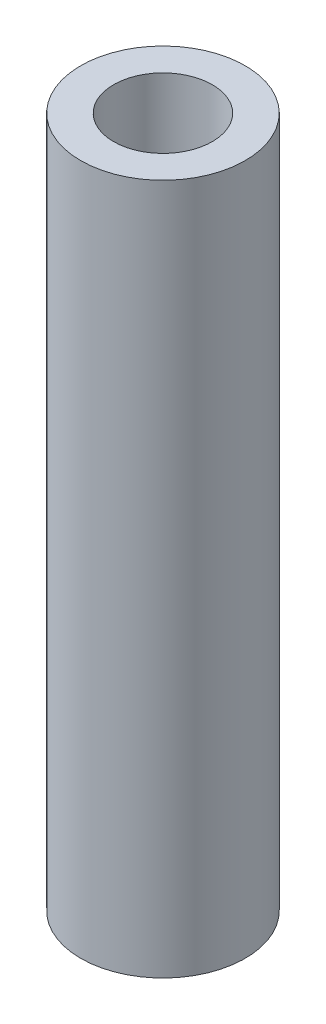
ISO-10303-21;
HEADER;
FILE_DESCRIPTION(('STEP AP214'),'2;1');
FILE_NAME('part.step','',(''),(''),'','','');
FILE_SCHEMA(('AUTOMOTIVE_DESIGN { 1 0 10303 214 1 1 1 1 }'));
ENDSEC;
DATA;
#1=APPLICATION_CONTEXT('core data for automotive mechanical design processes');
#2=APPLICATION_PROTOCOL_DEFINITION('international standard','automotive_design',2000,#1);
#3=PRODUCT_CONTEXT('',#1,'mechanical');
#4=PRODUCT('Part','Part','',(#3));
#5=PRODUCT_RELATED_PRODUCT_CATEGORY('part','',(#4));
#6=PRODUCT_DEFINITION_FORMATION('','',#4);
#7=PRODUCT_DEFINITION_CONTEXT('part definition',#1,'design');
#8=PRODUCT_DEFINITION('design','',#6,#7);
#9=PRODUCT_DEFINITION_SHAPE('','',#8);
#10=(LENGTH_UNIT() NAMED_UNIT(*) SI_UNIT(.MILLI.,.METRE.));
#11=(NAMED_UNIT(*) PLANE_ANGLE_UNIT() SI_UNIT($,.RADIAN.));
#12=(NAMED_UNIT(*) SI_UNIT($,.STERADIAN.) SOLID_ANGLE_UNIT());
#13=UNCERTAINTY_MEASURE_WITH_UNIT(LENGTH_MEASURE(1.E-05),#10,'distance_accuracy_value','');
#14=(GEOMETRIC_REPRESENTATION_CONTEXT(3) GLOBAL_UNCERTAINTY_ASSIGNED_CONTEXT((#13)) GLOBAL_UNIT_ASSIGNED_CONTEXT((#10,
#11,#12)) REPRESENTATION_CONTEXT('',''));
#15=CARTESIAN_POINT('',(0.,0.,0.));
#16=DIRECTION('',(0.,0.,1.));
#17=DIRECTION('',(1.,0.,0.));
#18=AXIS2_PLACEMENT_3D('',#15,#16,#17);
#19=CARTESIAN_POINT('',(0.,133.35,0.));
#20=DIRECTION('',(0.,1.,0.));
#21=DIRECTION('',(0.,0.,1.));
#22=AXIS2_PLACEMENT_3D('',#19,#20,#21);
#23=PLANE('',#22);
#24=CARTESIAN_POINT('',(0.,133.35,0.));
#25=DIRECTION('',(0.,1.,0.));
#26=DIRECTION('',(0.,0.,1.));
#27=AXIS2_PLACEMENT_3D('',#24,#25,#26);
#28=CIRCLE('',#27,15.875);
#29=CARTESIAN_POINT('',(0.,133.35,15.875));
#30=VERTEX_POINT('',#29);
#31=EDGE_CURVE('E10',#30,#30,#28,.T.);
#32=ORIENTED_EDGE('',*,*,#31,.T.);
#33=EDGE_LOOP('',(#32));
#34=FACE_BOUND('',#33,.T.);
#35=CARTESIAN_POINT('',(0.,133.35,0.));
#36=DIRECTION('',(0.,1.,0.));
#37=DIRECTION('',(0.,0.,1.));
#38=AXIS2_PLACEMENT_3D('',#35,#36,#37);
#39=CIRCLE('',#38,9.525);
#40=CARTESIAN_POINT('',(0.,133.35,9.525));
#41=VERTEX_POINT('',#40);
#42=EDGE_CURVE('E55',#41,#41,#39,.T.);
#43=ORIENTED_EDGE('',*,*,#42,.F.);
#44=EDGE_LOOP('',(#43));
#45=FACE_BOUND('',#44,.T.);
#46=ADVANCED_FACE('F40',(#34,#45),#23,.T.);
#47=CARTESIAN_POINT('',(0.,0.,0.));
#48=DIRECTION('',(0.,1.,0.));
#49=DIRECTION('',(0.,0.,1.));
#50=AXIS2_PLACEMENT_3D('',#47,#48,#49);
#51=PLANE('',#50);
#52=CARTESIAN_POINT('',(0.,0.,0.));
#53=DIRECTION('',(0.,1.,0.));
#54=DIRECTION('',(0.,0.,1.));
#55=AXIS2_PLACEMENT_3D('',#52,#53,#54);
#56=CIRCLE('',#55,15.875);
#57=CARTESIAN_POINT('',(0.,0.,15.875));
#58=VERTEX_POINT('',#57);
#59=EDGE_CURVE('E44',#58,#58,#56,.T.);
#60=ORIENTED_EDGE('',*,*,#59,.F.);
#61=EDGE_LOOP('',(#60));
#62=FACE_BOUND('',#61,.T.);
#63=CARTESIAN_POINT('',(0.,0.,0.));
#64=DIRECTION('',(0.,1.,0.));
#65=DIRECTION('',(0.,0.,1.));
#66=AXIS2_PLACEMENT_3D('',#63,#64,#65);
#67=CIRCLE('',#66,9.525);
#68=CARTESIAN_POINT('',(0.,0.,9.525));
#69=VERTEX_POINT('',#68);
#70=EDGE_CURVE('E57',#69,#69,#67,.T.);
#71=ORIENTED_EDGE('',*,*,#70,.T.);
#72=EDGE_LOOP('',(#71));
#73=FACE_BOUND('',#72,.T.);
#74=ADVANCED_FACE('F69',(#62,#73),#51,.F.);
#75=CARTESIAN_POINT('',(0.,133.35,0.));
#76=DIRECTION('',(0.,-1.,0.));
#77=DIRECTION('',(0.,0.,-1.));
#78=AXIS2_PLACEMENT_3D('',#75,#76,#77);
#79=CYLINDRICAL_SURFACE('',#78,15.875);
#80=ORIENTED_EDGE('',*,*,#31,.F.);
#81=EDGE_LOOP('',(#80));
#82=FACE_BOUND('',#81,.T.);
#83=ORIENTED_EDGE('',*,*,#59,.T.);
#84=EDGE_LOOP('',(#83));
#85=FACE_BOUND('',#84,.T.);
#86=ADVANCED_FACE('F42',(#82,#85),#79,.T.);
#87=CARTESIAN_POINT('',(0.,133.35,0.));
#88=DIRECTION('',(0.,-1.,0.));
#89=DIRECTION('',(0.,0.,-1.));
#90=AXIS2_PLACEMENT_3D('',#87,#88,#89);
#91=CYLINDRICAL_SURFACE('',#90,9.525);
#92=ORIENTED_EDGE('',*,*,#42,.T.);
#93=EDGE_LOOP('',(#92));
#94=FACE_BOUND('',#93,.T.);
#95=ORIENTED_EDGE('',*,*,#70,.F.);
#96=EDGE_LOOP('',(#95));
#97=FACE_BOUND('',#96,.T.);
#98=ADVANCED_FACE('F65',(#94,#97),#91,.F.);
#99=CLOSED_SHELL('',(#46,#74,#86,#98));
#100=MANIFOLD_SOLID_BREP('B2',#99);
#101=ADVANCED_BREP_SHAPE_REPRESENTATION('',(#18,#100),#14);
#102=SHAPE_DEFINITION_REPRESENTATION(#9,#101);
ENDSEC;
END-ISO-10303-21;
